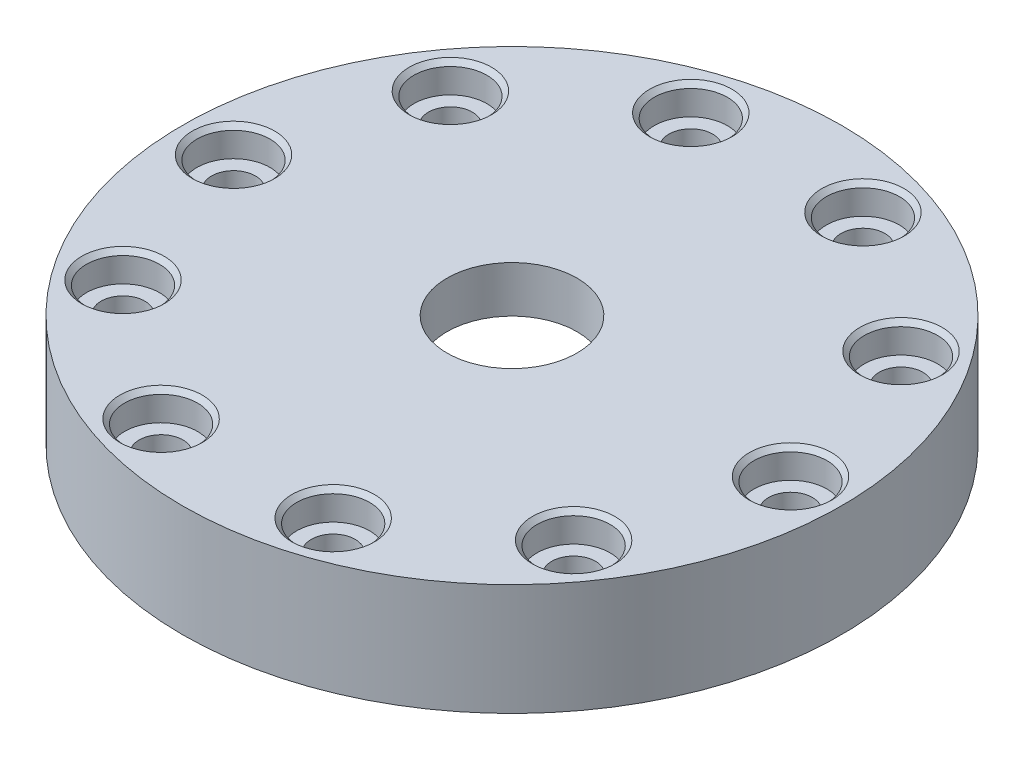
ISO-10303-21;
HEADER;
FILE_DESCRIPTION(('STEP AP214'),'2;1');
FILE_NAME('part.step','',(''),(''),'','','');
FILE_SCHEMA(('AUTOMOTIVE_DESIGN { 1 0 10303 214 1 1 1 1 }'));
ENDSEC;
DATA;
#1=APPLICATION_CONTEXT('core data for automotive mechanical design processes');
#2=APPLICATION_PROTOCOL_DEFINITION('international standard','automotive_design',2000,#1);
#3=PRODUCT_CONTEXT('',#1,'mechanical');
#4=PRODUCT('Part','Part','',(#3));
#5=PRODUCT_RELATED_PRODUCT_CATEGORY('part','',(#4));
#6=PRODUCT_DEFINITION_FORMATION('','',#4);
#7=PRODUCT_DEFINITION_CONTEXT('part definition',#1,'design');
#8=PRODUCT_DEFINITION('design','',#6,#7);
#9=PRODUCT_DEFINITION_SHAPE('','',#8);
#10=(LENGTH_UNIT() NAMED_UNIT(*) SI_UNIT(.MILLI.,.METRE.));
#11=(NAMED_UNIT(*) PLANE_ANGLE_UNIT() SI_UNIT($,.RADIAN.));
#12=(NAMED_UNIT(*) SI_UNIT($,.STERADIAN.) SOLID_ANGLE_UNIT());
#13=UNCERTAINTY_MEASURE_WITH_UNIT(LENGTH_MEASURE(1.E-05),#10,'distance_accuracy_value','');
#14=(GEOMETRIC_REPRESENTATION_CONTEXT(3) GLOBAL_UNCERTAINTY_ASSIGNED_CONTEXT((#13)) GLOBAL_UNIT_ASSIGNED_CONTEXT((#10,
#11,#12)) REPRESENTATION_CONTEXT('',''));
#15=CARTESIAN_POINT('',(0.,0.,0.));
#16=DIRECTION('',(0.,0.,1.));
#17=DIRECTION('',(1.,0.,0.));
#18=AXIS2_PLACEMENT_3D('',#15,#16,#17);
#19=CARTESIAN_POINT('',(0.,0.,0.));
#20=DIRECTION('',(0.,-1.,0.));
#21=DIRECTION('',(0.,0.,-1.));
#22=AXIS2_PLACEMENT_3D('',#19,#20,#21);
#23=CYLINDRICAL_SURFACE('',#22,8.89);
#24=CARTESIAN_POINT('',(0.,-6.35,0.));
#25=DIRECTION('',(0.,-1.,0.));
#26=DIRECTION('',(0.,0.,-1.));
#27=AXIS2_PLACEMENT_3D('',#24,#25,#26);
#28=CIRCLE('',#27,8.89);
#29=CARTESIAN_POINT('',(0.,-6.35,-8.89));
#30=VERTEX_POINT('',#29);
#31=EDGE_CURVE('E127',#30,#30,#28,.T.);
#32=ORIENTED_EDGE('',*,*,#31,.T.);
#33=EDGE_LOOP('',(#32));
#34=FACE_BOUND('',#33,.T.);
#35=CARTESIAN_POINT('',(0.,0.,0.));
#36=DIRECTION('',(0.,-1.,0.));
#37=DIRECTION('',(0.,0.,-1.));
#38=AXIS2_PLACEMENT_3D('',#35,#36,#37);
#39=CIRCLE('',#38,8.89);
#40=CARTESIAN_POINT('',(0.,0.,-8.89));
#41=VERTEX_POINT('',#40);
#42=EDGE_CURVE('E142',#41,#41,#39,.T.);
#43=ORIENTED_EDGE('',*,*,#42,.F.);
#44=EDGE_LOOP('',(#43));
#45=FACE_BOUND('',#44,.T.);
#46=ADVANCED_FACE('F39',(#34,#45),#23,.F.);
#47=CARTESIAN_POINT('',(8.89,-6.35,0.));
#48=DIRECTION('',(0.,-1.,0.));
#49=DIRECTION('',(0.,0.,-1.));
#50=AXIS2_PLACEMENT_3D('',#47,#48,#49);
#51=PLANE('',#50);
#52=CARTESIAN_POINT('',(0.,-6.35,0.));
#53=DIRECTION('',(0.,-1.,0.));
#54=DIRECTION('',(0.,0.,-1.));
#55=AXIS2_PLACEMENT_3D('',#52,#53,#54);
#56=CIRCLE('',#55,22.86);
#57=CARTESIAN_POINT('',(0.,-6.35,-22.86));
#58=VERTEX_POINT('',#57);
#59=EDGE_CURVE('E47',#58,#58,#56,.T.);
#60=ORIENTED_EDGE('',*,*,#59,.T.);
#61=EDGE_LOOP('',(#60));
#62=FACE_BOUND('',#61,.T.);
#63=ORIENTED_EDGE('',*,*,#31,.F.);
#64=EDGE_LOOP('',(#63));
#65=FACE_BOUND('',#64,.T.);
#66=ADVANCED_FACE('F276',(#62,#65),#51,.T.);
#67=CARTESIAN_POINT('',(0.,0.,0.));
#68=DIRECTION('',(0.,-1.,0.));
#69=DIRECTION('',(0.,0.,-1.));
#70=AXIS2_PLACEMENT_3D('',#67,#68,#69);
#71=CYLINDRICAL_SURFACE('',#70,24.13);
#72=CARTESIAN_POINT('',(0.,-7.62,0.));
#73=DIRECTION('',(0.,-1.,0.));
#74=DIRECTION('',(0.,0.,-1.));
#75=AXIS2_PLACEMENT_3D('',#72,#73,#74);
#76=CIRCLE('',#75,24.13);
#77=CARTESIAN_POINT('',(0.,-7.62,-24.13));
#78=VERTEX_POINT('',#77);
#79=EDGE_CURVE('E10',#78,#78,#76,.F.);
#80=ORIENTED_EDGE('',*,*,#79,.T.);
#81=EDGE_LOOP('',(#80));
#82=FACE_BOUND('',#81,.T.);
#83=CARTESIAN_POINT('',(0.,-15.2654,0.));
#84=DIRECTION('',(0.,-1.,0.));
#85=DIRECTION('',(0.,0.,-1.));
#86=AXIS2_PLACEMENT_3D('',#83,#84,#85);
#87=CIRCLE('',#86,24.13);
#88=CARTESIAN_POINT('',(0.,-15.2654,-24.13));
#89=VERTEX_POINT('',#88);
#90=EDGE_CURVE('E131',#89,#89,#87,.T.);
#91=ORIENTED_EDGE('',*,*,#90,.T.);
#92=EDGE_LOOP('',(#91));
#93=FACE_BOUND('',#92,.T.);
#94=ADVANCED_FACE('F282',(#82,#93),#71,.F.);
#95=CARTESIAN_POINT('',(24.13,-15.2654,0.));
#96=DIRECTION('',(0.,-1.,0.));
#97=DIRECTION('',(0.,0.,-1.));
#98=AXIS2_PLACEMENT_3D('',#95,#96,#97);
#99=PLANE('',#98);
#100=CARTESIAN_POINT('',(30.8235474856858,-15.2654,-22.3946181123428));
#101=DIRECTION('',(0.,-1.,0.));
#102=DIRECTION('',(0.,0.,-1.));
#103=AXIS2_PLACEMENT_3D('',#100,#101,#102);
#104=CIRCLE('',#103,3.00000000000001);
#105=CARTESIAN_POINT('',(30.8235474856858,-15.2654,-25.3946181123428));
#106=VERTEX_POINT('',#105);
#107=EDGE_CURVE('E245',#106,#106,#104,.T.);
#108=ORIENTED_EDGE('',*,*,#107,.F.);
#109=EDGE_LOOP('',(#108));
#110=FACE_BOUND('',#109,.T.);
#111=CARTESIAN_POINT('',(11.7735474856859,-15.2654,-36.2352532708452));
#112=DIRECTION('',(0.,-1.,0.));
#113=DIRECTION('',(0.,0.,-1.));
#114=AXIS2_PLACEMENT_3D('',#111,#112,#113);
#115=CIRCLE('',#114,3.00000000000001);
#116=CARTESIAN_POINT('',(11.7735474856859,-15.2654,-39.2352532708452));
#117=VERTEX_POINT('',#116);
#118=EDGE_CURVE('E234',#117,#117,#115,.T.);
#119=ORIENTED_EDGE('',*,*,#118,.F.);
#120=EDGE_LOOP('',(#119));
#121=FACE_BOUND('',#120,.T.);
#122=CARTESIAN_POINT('',(-11.7735474856851,-15.2654,-36.2352532708455));
#123=DIRECTION('',(0.,-1.,0.));
#124=DIRECTION('',(0.,0.,-1.));
#125=AXIS2_PLACEMENT_3D('',#122,#123,#124);
#126=CIRCLE('',#125,3.00000000000001);
#127=CARTESIAN_POINT('',(-11.7735474856851,-15.2654,-39.2352532708455));
#128=VERTEX_POINT('',#127);
#129=EDGE_CURVE('E224',#128,#128,#126,.T.);
#130=ORIENTED_EDGE('',*,*,#129,.F.);
#131=EDGE_LOOP('',(#130));
#132=FACE_BOUND('',#131,.T.);
#133=CARTESIAN_POINT('',(-30.8235474856853,-15.2654,-22.3946181123435));
#134=DIRECTION('',(0.,-1.,0.));
#135=DIRECTION('',(0.,0.,-1.));
#136=AXIS2_PLACEMENT_3D('',#133,#134,#135);
#137=CIRCLE('',#136,3.00000000000001);
#138=CARTESIAN_POINT('',(-30.8235474856853,-15.2654,-25.3946181123435));
#139=VERTEX_POINT('',#138);
#140=EDGE_CURVE('E214',#139,#139,#137,.T.);
#141=ORIENTED_EDGE('',*,*,#140,.F.);
#142=EDGE_LOOP('',(#141));
#143=FACE_BOUND('',#142,.T.);
#144=CARTESIAN_POINT('',(-38.1,-15.2654,0.));
#145=DIRECTION('',(0.,-1.,0.));
#146=DIRECTION('',(0.,0.,-1.));
#147=AXIS2_PLACEMENT_3D('',#144,#145,#146);
#148=CIRCLE('',#147,3.00000000000001);
#149=CARTESIAN_POINT('',(-38.1,-15.2654,-3.00000000000001));
#150=VERTEX_POINT('',#149);
#151=EDGE_CURVE('E203',#150,#150,#148,.T.);
#152=ORIENTED_EDGE('',*,*,#151,.F.);
#153=EDGE_LOOP('',(#152));
#154=FACE_BOUND('',#153,.T.);
#155=CARTESIAN_POINT('',(-30.8235474856856,-15.2654,22.3946181123431));
#156=DIRECTION('',(0.,-1.,0.));
#157=DIRECTION('',(0.,0.,-1.));
#158=AXIS2_PLACEMENT_3D('',#155,#156,#157);
#159=CIRCLE('',#158,3.00000000000001);
#160=CARTESIAN_POINT('',(-30.8235474856856,-15.2654,19.394618112343));
#161=VERTEX_POINT('',#160);
#162=EDGE_CURVE('E193',#161,#161,#159,.T.);
#163=ORIENTED_EDGE('',*,*,#162,.F.);
#164=EDGE_LOOP('',(#163));
#165=FACE_BOUND('',#164,.T.);
#166=CARTESIAN_POINT('',(-11.7735474856857,-15.2654,36.2352532708453));
#167=DIRECTION('',(0.,-1.,0.));
#168=DIRECTION('',(0.,0.,-1.));
#169=AXIS2_PLACEMENT_3D('',#166,#167,#168);
#170=CIRCLE('',#169,3.00000000000001);
#171=CARTESIAN_POINT('',(-11.7735474856857,-15.2654,33.2352532708453));
#172=VERTEX_POINT('',#171);
#173=EDGE_CURVE('E181',#172,#172,#170,.T.);
#174=ORIENTED_EDGE('',*,*,#173,.F.);
#175=EDGE_LOOP('',(#174));
#176=FACE_BOUND('',#175,.T.);
#177=CARTESIAN_POINT('',(11.7735474856854,-15.2654,36.2352532708454));
#178=DIRECTION('',(0.,-1.,0.));
#179=DIRECTION('',(0.,0.,-1.));
#180=AXIS2_PLACEMENT_3D('',#177,#178,#179);
#181=CIRCLE('',#180,3.00000000000001);
#182=CARTESIAN_POINT('',(11.7735474856854,-15.2654,33.2352532708454));
#183=VERTEX_POINT('',#182);
#184=EDGE_CURVE('E169',#183,#183,#181,.T.);
#185=ORIENTED_EDGE('',*,*,#184,.F.);
#186=EDGE_LOOP('',(#185));
#187=FACE_BOUND('',#186,.T.);
#188=CARTESIAN_POINT('',(30.8235474856855,-15.2654,22.3946181123433));
#189=DIRECTION('',(0.,-1.,0.));
#190=DIRECTION('',(0.,0.,-1.));
#191=AXIS2_PLACEMENT_3D('',#188,#189,#190);
#192=CIRCLE('',#191,3.00000000000001);
#193=CARTESIAN_POINT('',(30.8235474856855,-15.2654,19.3946181123433));
#194=VERTEX_POINT('',#193);
#195=EDGE_CURVE('E157',#194,#194,#192,.T.);
#196=ORIENTED_EDGE('',*,*,#195,.F.);
#197=EDGE_LOOP('',(#196));
#198=FACE_BOUND('',#197,.T.);
#199=CARTESIAN_POINT('',(38.1,-15.2654,0.));
#200=DIRECTION('',(0.,-1.,0.));
#201=DIRECTION('',(0.,0.,-1.));
#202=AXIS2_PLACEMENT_3D('',#199,#200,#201);
#203=CIRCLE('',#202,3.00000000000001);
#204=CARTESIAN_POINT('',(38.1,-15.2654,-3.00000000000001));
#205=VERTEX_POINT('',#204);
#206=EDGE_CURVE('E146',#205,#205,#203,.T.);
#207=ORIENTED_EDGE('',*,*,#206,.F.);
#208=EDGE_LOOP('',(#207));
#209=FACE_BOUND('',#208,.T.);
#210=CARTESIAN_POINT('',(0.,-15.2654,0.));
#211=DIRECTION('',(0.,-1.,0.));
#212=DIRECTION('',(0.,0.,-1.));
#213=AXIS2_PLACEMENT_3D('',#210,#211,#212);
#214=CIRCLE('',#213,45.085);
#215=CARTESIAN_POINT('',(0.,-15.2654,-45.085));
#216=VERTEX_POINT('',#215);
#217=EDGE_CURVE('E134',#216,#216,#214,.T.);
#218=ORIENTED_EDGE('',*,*,#217,.T.);
#219=EDGE_LOOP('',(#218));
#220=FACE_BOUND('',#219,.T.);
#221=ORIENTED_EDGE('',*,*,#90,.F.);
#222=EDGE_LOOP('',(#221));
#223=FACE_BOUND('',#222,.T.);
#224=ADVANCED_FACE('F360',(#110,#121,#132,#143,#154,#165,#176,#187,#198,#209,#220,#223),#99,.T.);
#225=CARTESIAN_POINT('',(0.,0.,0.));
#226=DIRECTION('',(0.,-1.,0.));
#227=DIRECTION('',(0.,0.,-1.));
#228=AXIS2_PLACEMENT_3D('',#225,#226,#227);
#229=CYLINDRICAL_SURFACE('',#228,45.085);
#230=CARTESIAN_POINT('',(0.,0.,0.));
#231=DIRECTION('',(0.,-1.,0.));
#232=DIRECTION('',(0.,0.,-1.));
#233=AXIS2_PLACEMENT_3D('',#230,#231,#232);
#234=CIRCLE('',#233,45.085);
#235=CARTESIAN_POINT('',(0.,0.,-45.085));
#236=VERTEX_POINT('',#235);
#237=EDGE_CURVE('E138',#236,#236,#234,.T.);
#238=ORIENTED_EDGE('',*,*,#237,.T.);
#239=EDGE_LOOP('',(#238));
#240=FACE_BOUND('',#239,.T.);
#241=ORIENTED_EDGE('',*,*,#217,.F.);
#242=EDGE_LOOP('',(#241));
#243=FACE_BOUND('',#242,.T.);
#244=ADVANCED_FACE('F334',(#240,#243),#229,.T.);
#245=CARTESIAN_POINT('',(8.89,0.,0.));
#246=DIRECTION('',(0.,1.,0.));
#247=DIRECTION('',(0.,0.,1.));
#248=AXIS2_PLACEMENT_3D('',#245,#246,#247);
#249=PLANE('',#248);
#250=CARTESIAN_POINT('',(30.8235474856858,0.,-22.3946181123428));
#251=DIRECTION('',(0.,1.,0.));
#252=DIRECTION('',(0.,0.,1.));
#253=AXIS2_PLACEMENT_3D('',#250,#251,#252);
#254=CIRCLE('',#253,5.63500000000006);
#255=CARTESIAN_POINT('',(30.8235474856858,0.,-16.7596181123428));
#256=VERTEX_POINT('',#255);
#257=EDGE_CURVE('E53',#256,#256,#254,.F.);
#258=ORIENTED_EDGE('',*,*,#257,.T.);
#259=EDGE_LOOP('',(#258));
#260=FACE_BOUND('',#259,.T.);
#261=CARTESIAN_POINT('',(11.7735474856859,0.,-36.2352532708452));
#262=DIRECTION('',(0.,1.,0.));
#263=DIRECTION('',(0.,0.,1.));
#264=AXIS2_PLACEMENT_3D('',#261,#262,#263);
#265=CIRCLE('',#264,5.63500000000001);
#266=CARTESIAN_POINT('',(11.7735474856859,0.,-30.6002532708452));
#267=VERTEX_POINT('',#266);
#268=EDGE_CURVE('E65',#267,#267,#265,.F.);
#269=ORIENTED_EDGE('',*,*,#268,.T.);
#270=EDGE_LOOP('',(#269));
#271=FACE_BOUND('',#270,.T.);
#272=CARTESIAN_POINT('',(-11.7735474856851,0.,-36.2352532708455));
#273=DIRECTION('',(0.,1.,0.));
#274=DIRECTION('',(0.,0.,1.));
#275=AXIS2_PLACEMENT_3D('',#272,#273,#274);
#276=CIRCLE('',#275,5.63500000000006);
#277=CARTESIAN_POINT('',(-11.7735474856851,0.,-30.6002532708454));
#278=VERTEX_POINT('',#277);
#279=EDGE_CURVE('E71',#278,#278,#276,.F.);
#280=ORIENTED_EDGE('',*,*,#279,.T.);
#281=EDGE_LOOP('',(#280));
#282=FACE_BOUND('',#281,.T.);
#283=CARTESIAN_POINT('',(-30.8235474856853,0.,-22.3946181123435));
#284=DIRECTION('',(0.,1.,0.));
#285=DIRECTION('',(0.,0.,1.));
#286=AXIS2_PLACEMENT_3D('',#283,#284,#285);
#287=CIRCLE('',#286,5.63500000000006);
#288=CARTESIAN_POINT('',(-30.8235474856853,0.,-16.7596181123434));
#289=VERTEX_POINT('',#288);
#290=EDGE_CURVE('E77',#289,#289,#287,.F.);
#291=ORIENTED_EDGE('',*,*,#290,.T.);
#292=EDGE_LOOP('',(#291));
#293=FACE_BOUND('',#292,.T.);
#294=CARTESIAN_POINT('',(-38.1,0.,0.));
#295=DIRECTION('',(0.,1.,0.));
#296=DIRECTION('',(0.,0.,1.));
#297=AXIS2_PLACEMENT_3D('',#294,#295,#296);
#298=CIRCLE('',#297,5.63500000000006);
#299=CARTESIAN_POINT('',(-38.1,0.,5.63500000000006));
#300=VERTEX_POINT('',#299);
#301=EDGE_CURVE('E83',#300,#300,#298,.F.);
#302=ORIENTED_EDGE('',*,*,#301,.T.);
#303=EDGE_LOOP('',(#302));
#304=FACE_BOUND('',#303,.T.);
#305=CARTESIAN_POINT('',(-30.8235474856856,0.,22.3946181123431));
#306=DIRECTION('',(0.,1.,0.));
#307=DIRECTION('',(0.,0.,1.));
#308=AXIS2_PLACEMENT_3D('',#305,#306,#307);
#309=CIRCLE('',#308,5.63500000000006);
#310=CARTESIAN_POINT('',(-30.8235474856856,0.,28.0296181123431));
#311=VERTEX_POINT('',#310);
#312=EDGE_CURVE('E89',#311,#311,#309,.F.);
#313=ORIENTED_EDGE('',*,*,#312,.T.);
#314=EDGE_LOOP('',(#313));
#315=FACE_BOUND('',#314,.T.);
#316=CARTESIAN_POINT('',(-11.7735474856857,0.,36.2352532708453));
#317=DIRECTION('',(0.,1.,0.));
#318=DIRECTION('',(0.,0.,1.));
#319=AXIS2_PLACEMENT_3D('',#316,#317,#318);
#320=CIRCLE('',#319,5.63500000000006);
#321=CARTESIAN_POINT('',(-11.7735474856857,0.,41.8702532708454));
#322=VERTEX_POINT('',#321);
#323=EDGE_CURVE('E95',#322,#322,#320,.F.);
#324=ORIENTED_EDGE('',*,*,#323,.T.);
#325=EDGE_LOOP('',(#324));
#326=FACE_BOUND('',#325,.T.);
#327=CARTESIAN_POINT('',(11.7735474856854,0.,36.2352532708454));
#328=DIRECTION('',(0.,1.,0.));
#329=DIRECTION('',(0.,0.,1.));
#330=AXIS2_PLACEMENT_3D('',#327,#328,#329);
#331=CIRCLE('',#330,5.63500000000006);
#332=CARTESIAN_POINT('',(11.7735474856854,0.,41.8702532708455));
#333=VERTEX_POINT('',#332);
#334=EDGE_CURVE('E103',#333,#333,#331,.F.);
#335=ORIENTED_EDGE('',*,*,#334,.T.);
#336=EDGE_LOOP('',(#335));
#337=FACE_BOUND('',#336,.T.);
#338=CARTESIAN_POINT('',(30.8235474856855,0.,22.3946181123433));
#339=DIRECTION('',(0.,1.,0.));
#340=DIRECTION('',(0.,0.,1.));
#341=AXIS2_PLACEMENT_3D('',#338,#339,#340);
#342=CIRCLE('',#341,5.63500000000006);
#343=CARTESIAN_POINT('',(30.8235474856855,0.,28.0296181123433));
#344=VERTEX_POINT('',#343);
#345=EDGE_CURVE('E111',#344,#344,#342,.F.);
#346=ORIENTED_EDGE('',*,*,#345,.T.);
#347=EDGE_LOOP('',(#346));
#348=FACE_BOUND('',#347,.T.);
#349=CARTESIAN_POINT('',(38.1,0.,0.));
#350=DIRECTION('',(0.,1.,0.));
#351=DIRECTION('',(0.,0.,1.));
#352=AXIS2_PLACEMENT_3D('',#349,#350,#351);
#353=CIRCLE('',#352,5.63500000000006);
#354=CARTESIAN_POINT('',(38.1,0.,5.63500000000006));
#355=VERTEX_POINT('',#354);
#356=EDGE_CURVE('E119',#355,#355,#353,.F.);
#357=ORIENTED_EDGE('',*,*,#356,.T.);
#358=EDGE_LOOP('',(#357));
#359=FACE_BOUND('',#358,.T.);
#360=ORIENTED_EDGE('',*,*,#42,.T.);
#361=EDGE_LOOP('',(#360));
#362=FACE_BOUND('',#361,.T.);
#363=ORIENTED_EDGE('',*,*,#237,.F.);
#364=EDGE_LOOP('',(#363));
#365=FACE_BOUND('',#364,.T.);
#366=ADVANCED_FACE('F330',(#260,#271,#282,#293,#304,#315,#326,#337,#348,#359,#362,#365),#249,.T.);
#367=CARTESIAN_POINT('',(38.1,0.,0.));
#368=DIRECTION('',(0.,1.,0.));
#369=DIRECTION('',(0.,0.,1.));
#370=AXIS2_PLACEMENT_3D('',#367,#368,#369);
#371=CYLINDRICAL_SURFACE('',#370,3.00000000000001);
#372=CARTESIAN_POINT('',(38.1,-4.,0.));
#373=DIRECTION('',(0.,1.,0.));
#374=DIRECTION('',(0.,0.,1.));
#375=AXIS2_PLACEMENT_3D('',#372,#373,#374);
#376=CIRCLE('',#375,3.00000000000001);
#377=CARTESIAN_POINT('',(38.1,-4.,3.00000000000001));
#378=VERTEX_POINT('',#377);
#379=EDGE_CURVE('E149',#378,#378,#376,.T.);
#380=ORIENTED_EDGE('',*,*,#379,.T.);
#381=EDGE_LOOP('',(#380));
#382=FACE_BOUND('',#381,.T.);
#383=ORIENTED_EDGE('',*,*,#206,.T.);
#384=EDGE_LOOP('',(#383));
#385=FACE_BOUND('',#384,.T.);
#386=ADVANCED_FACE('F333',(#382,#385),#371,.F.);
#387=CARTESIAN_POINT('',(41.1,-4.,0.));
#388=DIRECTION('',(0.,-1.,0.));
#389=DIRECTION('',(0.,0.,-1.));
#390=AXIS2_PLACEMENT_3D('',#387,#388,#389);
#391=PLANE('',#390);
#392=ORIENTED_EDGE('',*,*,#379,.F.);
#393=EDGE_LOOP('',(#392));
#394=FACE_BOUND('',#393,.T.);
#395=CARTESIAN_POINT('',(38.1,-4.,0.));
#396=DIRECTION('',(0.,1.,0.));
#397=DIRECTION('',(0.,0.,1.));
#398=AXIS2_PLACEMENT_3D('',#395,#396,#397);
#399=CIRCLE('',#398,5.00000000000001);
#400=CARTESIAN_POINT('',(38.1,-4.,5.00000000000001));
#401=VERTEX_POINT('',#400);
#402=EDGE_CURVE('E153',#401,#401,#399,.T.);
#403=ORIENTED_EDGE('',*,*,#402,.T.);
#404=EDGE_LOOP('',(#403));
#405=FACE_BOUND('',#404,.T.);
#406=ADVANCED_FACE('F376',(#394,#405),#391,.F.);
#407=CARTESIAN_POINT('',(38.1,0.,0.));
#408=DIRECTION('',(0.,1.,0.));
#409=DIRECTION('',(0.,0.,1.));
#410=AXIS2_PLACEMENT_3D('',#407,#408,#409);
#411=CYLINDRICAL_SURFACE('',#410,5.00000000000001);
#412=CARTESIAN_POINT('',(38.1,-0.635000000000034,0.));
#413=DIRECTION('',(0.,1.,0.));
#414=DIRECTION('',(0.,0.,1.));
#415=AXIS2_PLACEMENT_3D('',#412,#413,#414);
#416=CIRCLE('',#415,5.00000000000001);
#417=CARTESIAN_POINT('',(38.1,-0.635000000000034,5.00000000000001));
#418=VERTEX_POINT('',#417);
#419=EDGE_CURVE('E123',#418,#418,#416,.T.);
#420=ORIENTED_EDGE('',*,*,#419,.T.);
#421=EDGE_LOOP('',(#420));
#422=FACE_BOUND('',#421,.T.);
#423=ORIENTED_EDGE('',*,*,#402,.F.);
#424=EDGE_LOOP('',(#423));
#425=FACE_BOUND('',#424,.T.);
#426=ADVANCED_FACE('F290',(#422,#425),#411,.F.);
#427=CARTESIAN_POINT('',(38.1,-0.635000000000034,0.));
#428=DIRECTION('',(0.,1.,0.));
#429=DIRECTION('',(0.,0.,1.));
#430=AXIS2_PLACEMENT_3D('',#427,#428,#429);
#431=CONICAL_SURFACE('',#430,5.00000000000001,0.785398163397457);
#432=ORIENTED_EDGE('',*,*,#356,.F.);
#433=EDGE_LOOP('',(#432));
#434=FACE_BOUND('',#433,.T.);
#435=ORIENTED_EDGE('',*,*,#419,.F.);
#436=EDGE_LOOP('',(#435));
#437=FACE_BOUND('',#436,.T.);
#438=ADVANCED_FACE('F287',(#434,#437),#431,.F.);
#439=CARTESIAN_POINT('',(30.8235474856855,0.,22.3946181123433));
#440=DIRECTION('',(0.,1.,0.));
#441=DIRECTION('',(0.,0.,1.));
#442=AXIS2_PLACEMENT_3D('',#439,#440,#441);
#443=CYLINDRICAL_SURFACE('',#442,3.00000000000001);
#444=CARTESIAN_POINT('',(30.8235474856855,-4.,22.3946181123433));
#445=DIRECTION('',(0.,1.,0.));
#446=DIRECTION('',(0.,0.,1.));
#447=AXIS2_PLACEMENT_3D('',#444,#445,#446);
#448=CIRCLE('',#447,3.00000000000001);
#449=CARTESIAN_POINT('',(30.8235474856855,-4.,25.3946181123433));
#450=VERTEX_POINT('',#449);
#451=EDGE_CURVE('E161',#450,#450,#448,.T.);
#452=ORIENTED_EDGE('',*,*,#451,.T.);
#453=EDGE_LOOP('',(#452));
#454=FACE_BOUND('',#453,.T.);
#455=ORIENTED_EDGE('',*,*,#195,.T.);
#456=EDGE_LOOP('',(#455));
#457=FACE_BOUND('',#456,.T.);
#458=ADVANCED_FACE('F289',(#454,#457),#443,.F.);
#459=CARTESIAN_POINT('',(33.8235474856855,-4.,22.3946181123433));
#460=DIRECTION('',(0.,-1.,0.));
#461=DIRECTION('',(0.,0.,-1.));
#462=AXIS2_PLACEMENT_3D('',#459,#460,#461);
#463=PLANE('',#462);
#464=ORIENTED_EDGE('',*,*,#451,.F.);
#465=EDGE_LOOP('',(#464));
#466=FACE_BOUND('',#465,.T.);
#467=CARTESIAN_POINT('',(30.8235474856855,-4.,22.3946181123433));
#468=DIRECTION('',(0.,1.,0.));
#469=DIRECTION('',(0.,0.,1.));
#470=AXIS2_PLACEMENT_3D('',#467,#468,#469);
#471=CIRCLE('',#470,5.00000000000002);
#472=CARTESIAN_POINT('',(30.8235474856855,-4.,27.3946181123433));
#473=VERTEX_POINT('',#472);
#474=EDGE_CURVE('E165',#473,#473,#471,.T.);
#475=ORIENTED_EDGE('',*,*,#474,.T.);
#476=EDGE_LOOP('',(#475));
#477=FACE_BOUND('',#476,.T.);
#478=ADVANCED_FACE('F386',(#466,#477),#463,.F.);
#479=CARTESIAN_POINT('',(30.8235474856855,0.,22.3946181123433));
#480=DIRECTION('',(0.,1.,0.));
#481=DIRECTION('',(0.,0.,1.));
#482=AXIS2_PLACEMENT_3D('',#479,#480,#481);
#483=CYLINDRICAL_SURFACE('',#482,5.00000000000002);
#484=CARTESIAN_POINT('',(30.8235474856855,-0.635000000000031,22.3946181123433));
#485=DIRECTION('',(0.,1.,0.));
#486=DIRECTION('',(0.,0.,1.));
#487=AXIS2_PLACEMENT_3D('',#484,#485,#486);
#488=CIRCLE('',#487,5.00000000000002);
#489=CARTESIAN_POINT('',(30.8235474856855,-0.635000000000031,27.3946181123433));
#490=VERTEX_POINT('',#489);
#491=EDGE_CURVE('E115',#490,#490,#488,.T.);
#492=ORIENTED_EDGE('',*,*,#491,.T.);
#493=EDGE_LOOP('',(#492));
#494=FACE_BOUND('',#493,.T.);
#495=ORIENTED_EDGE('',*,*,#474,.F.);
#496=EDGE_LOOP('',(#495));
#497=FACE_BOUND('',#496,.T.);
#498=ADVANCED_FACE('F390',(#494,#497),#483,.F.);
#499=CARTESIAN_POINT('',(11.7735474856854,0.,36.2352532708454));
#500=DIRECTION('',(0.,1.,0.));
#501=DIRECTION('',(0.,0.,1.));
#502=AXIS2_PLACEMENT_3D('',#499,#500,#501);
#503=CYLINDRICAL_SURFACE('',#502,3.00000000000001);
#504=CARTESIAN_POINT('',(11.7735474856854,-4.,36.2352532708454));
#505=DIRECTION('',(0.,1.,0.));
#506=DIRECTION('',(0.,0.,1.));
#507=AXIS2_PLACEMENT_3D('',#504,#505,#506);
#508=CIRCLE('',#507,3.00000000000001);
#509=CARTESIAN_POINT('',(11.7735474856854,-4.,39.2352532708454));
#510=VERTEX_POINT('',#509);
#511=EDGE_CURVE('E173',#510,#510,#508,.T.);
#512=ORIENTED_EDGE('',*,*,#511,.T.);
#513=EDGE_LOOP('',(#512));
#514=FACE_BOUND('',#513,.T.);
#515=ORIENTED_EDGE('',*,*,#184,.T.);
#516=EDGE_LOOP('',(#515));
#517=FACE_BOUND('',#516,.T.);
#518=ADVANCED_FACE('F394',(#514,#517),#503,.F.);
#519=CARTESIAN_POINT('',(14.7735474856854,-4.,36.2352532708454));
#520=DIRECTION('',(0.,-1.,0.));
#521=DIRECTION('',(0.,0.,-1.));
#522=AXIS2_PLACEMENT_3D('',#519,#520,#521);
#523=PLANE('',#522);
#524=ORIENTED_EDGE('',*,*,#511,.F.);
#525=EDGE_LOOP('',(#524));
#526=FACE_BOUND('',#525,.T.);
#527=CARTESIAN_POINT('',(11.7735474856854,-4.,36.2352532708454));
#528=DIRECTION('',(0.,1.,0.));
#529=DIRECTION('',(0.,0.,1.));
#530=AXIS2_PLACEMENT_3D('',#527,#528,#529);
#531=CIRCLE('',#530,5.00000000000002);
#532=CARTESIAN_POINT('',(11.7735474856854,-4.,41.2352532708454));
#533=VERTEX_POINT('',#532);
#534=EDGE_CURVE('E177',#533,#533,#531,.T.);
#535=ORIENTED_EDGE('',*,*,#534,.T.);
#536=EDGE_LOOP('',(#535));
#537=FACE_BOUND('',#536,.T.);
#538=ADVANCED_FACE('F398',(#526,#537),#523,.F.);
#539=CARTESIAN_POINT('',(11.7735474856854,0.,36.2352532708454));
#540=DIRECTION('',(0.,1.,0.));
#541=DIRECTION('',(0.,0.,1.));
#542=AXIS2_PLACEMENT_3D('',#539,#540,#541);
#543=CYLINDRICAL_SURFACE('',#542,5.00000000000002);
#544=CARTESIAN_POINT('',(11.7735474856854,-0.635000000000031,36.2352532708454));
#545=DIRECTION('',(0.,1.,0.));
#546=DIRECTION('',(0.,0.,1.));
#547=AXIS2_PLACEMENT_3D('',#544,#545,#546);
#548=CIRCLE('',#547,5.00000000000002);
#549=CARTESIAN_POINT('',(11.7735474856854,-0.635000000000031,41.2352532708454));
#550=VERTEX_POINT('',#549);
#551=EDGE_CURVE('E107',#550,#550,#548,.T.);
#552=ORIENTED_EDGE('',*,*,#551,.T.);
#553=EDGE_LOOP('',(#552));
#554=FACE_BOUND('',#553,.T.);
#555=ORIENTED_EDGE('',*,*,#534,.F.);
#556=EDGE_LOOP('',(#555));
#557=FACE_BOUND('',#556,.T.);
#558=ADVANCED_FACE('F402',(#554,#557),#543,.F.);
#559=CARTESIAN_POINT('',(-11.7735474856857,0.,36.2352532708453));
#560=DIRECTION('',(0.,1.,0.));
#561=DIRECTION('',(0.,0.,1.));
#562=AXIS2_PLACEMENT_3D('',#559,#560,#561);
#563=CYLINDRICAL_SURFACE('',#562,3.00000000000001);
#564=CARTESIAN_POINT('',(-11.7735474856857,-4.,36.2352532708453));
#565=DIRECTION('',(0.,1.,0.));
#566=DIRECTION('',(0.,0.,1.));
#567=AXIS2_PLACEMENT_3D('',#564,#565,#566);
#568=CIRCLE('',#567,3.00000000000001);
#569=CARTESIAN_POINT('',(-11.7735474856857,-4.,39.2352532708453));
#570=VERTEX_POINT('',#569);
#571=EDGE_CURVE('E185',#570,#570,#568,.T.);
#572=ORIENTED_EDGE('',*,*,#571,.T.);
#573=EDGE_LOOP('',(#572));
#574=FACE_BOUND('',#573,.T.);
#575=ORIENTED_EDGE('',*,*,#173,.T.);
#576=EDGE_LOOP('',(#575));
#577=FACE_BOUND('',#576,.T.);
#578=ADVANCED_FACE('F406',(#574,#577),#563,.F.);
#579=CARTESIAN_POINT('',(-8.77354748568565,-4.,36.2352532708453));
#580=DIRECTION('',(0.,-1.,0.));
#581=DIRECTION('',(0.,0.,-1.));
#582=AXIS2_PLACEMENT_3D('',#579,#580,#581);
#583=PLANE('',#582);
#584=ORIENTED_EDGE('',*,*,#571,.F.);
#585=EDGE_LOOP('',(#584));
#586=FACE_BOUND('',#585,.T.);
#587=CARTESIAN_POINT('',(-11.7735474856857,-4.,36.2352532708453));
#588=DIRECTION('',(0.,1.,0.));
#589=DIRECTION('',(0.,0.,1.));
#590=AXIS2_PLACEMENT_3D('',#587,#588,#589);
#591=CIRCLE('',#590,5.00000000000001);
#592=CARTESIAN_POINT('',(-11.7735474856857,-4.,41.2352532708453));
#593=VERTEX_POINT('',#592);
#594=EDGE_CURVE('E189',#593,#593,#591,.T.);
#595=ORIENTED_EDGE('',*,*,#594,.T.);
#596=EDGE_LOOP('',(#595));
#597=FACE_BOUND('',#596,.T.);
#598=ADVANCED_FACE('F410',(#586,#597),#583,.F.);
#599=CARTESIAN_POINT('',(-11.7735474856857,0.,36.2352532708453));
#600=DIRECTION('',(0.,1.,0.));
#601=DIRECTION('',(0.,0.,1.));
#602=AXIS2_PLACEMENT_3D('',#599,#600,#601);
#603=CYLINDRICAL_SURFACE('',#602,5.00000000000001);
#604=CARTESIAN_POINT('',(-11.7735474856857,-0.635000000000031,36.2352532708453));
#605=DIRECTION('',(0.,1.,0.));
#606=DIRECTION('',(0.,0.,1.));
#607=AXIS2_PLACEMENT_3D('',#604,#605,#606);
#608=CIRCLE('',#607,5.00000000000001);
#609=CARTESIAN_POINT('',(-11.7735474856857,-0.635000000000031,41.2352532708453));
#610=VERTEX_POINT('',#609);
#611=EDGE_CURVE('E99',#610,#610,#608,.T.);
#612=ORIENTED_EDGE('',*,*,#611,.T.);
#613=EDGE_LOOP('',(#612));
#614=FACE_BOUND('',#613,.T.);
#615=ORIENTED_EDGE('',*,*,#594,.F.);
#616=EDGE_LOOP('',(#615));
#617=FACE_BOUND('',#616,.T.);
#618=ADVANCED_FACE('F414',(#614,#617),#603,.F.);
#619=CARTESIAN_POINT('',(-30.8235474856856,0.,22.3946181123431));
#620=DIRECTION('',(0.,1.,0.));
#621=DIRECTION('',(0.,0.,1.));
#622=AXIS2_PLACEMENT_3D('',#619,#620,#621);
#623=CYLINDRICAL_SURFACE('',#622,3.00000000000001);
#624=CARTESIAN_POINT('',(-30.8235474856856,-4.,22.3946181123431));
#625=DIRECTION('',(0.,1.,0.));
#626=DIRECTION('',(0.,0.,1.));
#627=AXIS2_PLACEMENT_3D('',#624,#625,#626);
#628=CIRCLE('',#627,3.00000000000001);
#629=CARTESIAN_POINT('',(-30.8235474856856,-4.,25.3946181123431));
#630=VERTEX_POINT('',#629);
#631=EDGE_CURVE('E197',#630,#630,#628,.T.);
#632=ORIENTED_EDGE('',*,*,#631,.T.);
#633=EDGE_LOOP('',(#632));
#634=FACE_BOUND('',#633,.T.);
#635=ORIENTED_EDGE('',*,*,#162,.T.);
#636=EDGE_LOOP('',(#635));
#637=FACE_BOUND('',#636,.T.);
#638=ADVANCED_FACE('F418',(#634,#637),#623,.F.);
#639=CARTESIAN_POINT('',(-27.8235474856856,-4.,22.3946181123431));
#640=DIRECTION('',(0.,-1.,0.));
#641=DIRECTION('',(0.,0.,-1.));
#642=AXIS2_PLACEMENT_3D('',#639,#640,#641);
#643=PLANE('',#642);
#644=ORIENTED_EDGE('',*,*,#631,.F.);
#645=EDGE_LOOP('',(#644));
#646=FACE_BOUND('',#645,.T.);
#647=CARTESIAN_POINT('',(-30.8235474856856,-4.,22.3946181123431));
#648=DIRECTION('',(0.,1.,0.));
#649=DIRECTION('',(0.,0.,1.));
#650=AXIS2_PLACEMENT_3D('',#647,#648,#649);
#651=CIRCLE('',#650,5.00000000000002);
#652=CARTESIAN_POINT('',(-30.8235474856856,-4.,27.3946181123431));
#653=VERTEX_POINT('',#652);
#654=EDGE_CURVE('E200',#653,#653,#651,.T.);
#655=ORIENTED_EDGE('',*,*,#654,.T.);
#656=EDGE_LOOP('',(#655));
#657=FACE_BOUND('',#656,.T.);
#658=ADVANCED_FACE('F422',(#646,#657),#643,.F.);
#659=CARTESIAN_POINT('',(-30.8235474856856,0.,22.3946181123431));
#660=DIRECTION('',(0.,1.,0.));
#661=DIRECTION('',(0.,0.,1.));
#662=AXIS2_PLACEMENT_3D('',#659,#660,#661);
#663=CYLINDRICAL_SURFACE('',#662,5.00000000000002);
#664=CARTESIAN_POINT('',(-30.8235474856856,-0.635000000000031,22.3946181123431));
#665=DIRECTION('',(0.,1.,0.));
#666=DIRECTION('',(0.,0.,1.));
#667=AXIS2_PLACEMENT_3D('',#664,#665,#666);
#668=CIRCLE('',#667,5.00000000000002);
#669=CARTESIAN_POINT('',(-30.8235474856856,-0.635000000000031,27.3946181123431));
#670=VERTEX_POINT('',#669);
#671=EDGE_CURVE('E92',#670,#670,#668,.T.);
#672=ORIENTED_EDGE('',*,*,#671,.T.);
#673=EDGE_LOOP('',(#672));
#674=FACE_BOUND('',#673,.T.);
#675=ORIENTED_EDGE('',*,*,#654,.F.);
#676=EDGE_LOOP('',(#675));
#677=FACE_BOUND('',#676,.T.);
#678=ADVANCED_FACE('F426',(#674,#677),#663,.F.);
#679=CARTESIAN_POINT('',(-38.1,0.,0.));
#680=DIRECTION('',(0.,1.,0.));
#681=DIRECTION('',(0.,0.,1.));
#682=AXIS2_PLACEMENT_3D('',#679,#680,#681);
#683=CYLINDRICAL_SURFACE('',#682,3.00000000000001);
#684=CARTESIAN_POINT('',(-38.1,-4.,0.));
#685=DIRECTION('',(0.,1.,0.));
#686=DIRECTION('',(0.,0.,1.));
#687=AXIS2_PLACEMENT_3D('',#684,#685,#686);
#688=CIRCLE('',#687,3.00000000000001);
#689=CARTESIAN_POINT('',(-38.1,-4.,3.00000000000001));
#690=VERTEX_POINT('',#689);
#691=EDGE_CURVE('E207',#690,#690,#688,.T.);
#692=ORIENTED_EDGE('',*,*,#691,.T.);
#693=EDGE_LOOP('',(#692));
#694=FACE_BOUND('',#693,.T.);
#695=ORIENTED_EDGE('',*,*,#151,.T.);
#696=EDGE_LOOP('',(#695));
#697=FACE_BOUND('',#696,.T.);
#698=ADVANCED_FACE('F430',(#694,#697),#683,.F.);
#699=CARTESIAN_POINT('',(-35.1,-4.,0.));
#700=DIRECTION('',(0.,-1.,0.));
#701=DIRECTION('',(0.,0.,-1.));
#702=AXIS2_PLACEMENT_3D('',#699,#700,#701);
#703=PLANE('',#702);
#704=ORIENTED_EDGE('',*,*,#691,.F.);
#705=EDGE_LOOP('',(#704));
#706=FACE_BOUND('',#705,.T.);
#707=CARTESIAN_POINT('',(-38.1,-4.,0.));
#708=DIRECTION('',(0.,1.,0.));
#709=DIRECTION('',(0.,0.,1.));
#710=AXIS2_PLACEMENT_3D('',#707,#708,#709);
#711=CIRCLE('',#710,5.00000000000001);
#712=CARTESIAN_POINT('',(-38.1,-4.,5.00000000000001));
#713=VERTEX_POINT('',#712);
#714=EDGE_CURVE('E210',#713,#713,#711,.T.);
#715=ORIENTED_EDGE('',*,*,#714,.T.);
#716=EDGE_LOOP('',(#715));
#717=FACE_BOUND('',#716,.T.);
#718=ADVANCED_FACE('F434',(#706,#717),#703,.F.);
#719=CARTESIAN_POINT('',(-38.1,0.,0.));
#720=DIRECTION('',(0.,1.,0.));
#721=DIRECTION('',(0.,0.,1.));
#722=AXIS2_PLACEMENT_3D('',#719,#720,#721);
#723=CYLINDRICAL_SURFACE('',#722,5.00000000000001);
#724=CARTESIAN_POINT('',(-38.1,-0.635000000000034,0.));
#725=DIRECTION('',(0.,1.,0.));
#726=DIRECTION('',(0.,0.,1.));
#727=AXIS2_PLACEMENT_3D('',#724,#725,#726);
#728=CIRCLE('',#727,5.00000000000001);
#729=CARTESIAN_POINT('',(-38.1,-0.635000000000034,5.00000000000001));
#730=VERTEX_POINT('',#729);
#731=EDGE_CURVE('E86',#730,#730,#728,.T.);
#732=ORIENTED_EDGE('',*,*,#731,.T.);
#733=EDGE_LOOP('',(#732));
#734=FACE_BOUND('',#733,.T.);
#735=ORIENTED_EDGE('',*,*,#714,.F.);
#736=EDGE_LOOP('',(#735));
#737=FACE_BOUND('',#736,.T.);
#738=ADVANCED_FACE('F438',(#734,#737),#723,.F.);
#739=CARTESIAN_POINT('',(-30.8235474856853,0.,-22.3946181123435));
#740=DIRECTION('',(0.,1.,0.));
#741=DIRECTION('',(0.,0.,1.));
#742=AXIS2_PLACEMENT_3D('',#739,#740,#741);
#743=CYLINDRICAL_SURFACE('',#742,3.00000000000001);
#744=CARTESIAN_POINT('',(-30.8235474856853,-4.,-22.3946181123435));
#745=DIRECTION('',(0.,1.,0.));
#746=DIRECTION('',(0.,0.,1.));
#747=AXIS2_PLACEMENT_3D('',#744,#745,#746);
#748=CIRCLE('',#747,3.00000000000001);
#749=CARTESIAN_POINT('',(-30.8235474856853,-4.,-19.3946181123435));
#750=VERTEX_POINT('',#749);
#751=EDGE_CURVE('E218',#750,#750,#748,.T.);
#752=ORIENTED_EDGE('',*,*,#751,.T.);
#753=EDGE_LOOP('',(#752));
#754=FACE_BOUND('',#753,.T.);
#755=ORIENTED_EDGE('',*,*,#140,.T.);
#756=EDGE_LOOP('',(#755));
#757=FACE_BOUND('',#756,.T.);
#758=ADVANCED_FACE('F442',(#754,#757),#743,.F.);
#759=CARTESIAN_POINT('',(-27.8235474856853,-4.,-22.3946181123435));
#760=DIRECTION('',(0.,-1.,0.));
#761=DIRECTION('',(0.,0.,-1.));
#762=AXIS2_PLACEMENT_3D('',#759,#760,#761);
#763=PLANE('',#762);
#764=ORIENTED_EDGE('',*,*,#751,.F.);
#765=EDGE_LOOP('',(#764));
#766=FACE_BOUND('',#765,.T.);
#767=CARTESIAN_POINT('',(-30.8235474856853,-4.,-22.3946181123435));
#768=DIRECTION('',(0.,1.,0.));
#769=DIRECTION('',(0.,0.,1.));
#770=AXIS2_PLACEMENT_3D('',#767,#768,#769);
#771=CIRCLE('',#770,5.00000000000002);
#772=CARTESIAN_POINT('',(-30.8235474856853,-4.,-17.3946181123435));
#773=VERTEX_POINT('',#772);
#774=EDGE_CURVE('E221',#773,#773,#771,.T.);
#775=ORIENTED_EDGE('',*,*,#774,.T.);
#776=EDGE_LOOP('',(#775));
#777=FACE_BOUND('',#776,.T.);
#778=ADVANCED_FACE('F446',(#766,#777),#763,.F.);
#779=CARTESIAN_POINT('',(-30.8235474856853,0.,-22.3946181123435));
#780=DIRECTION('',(0.,1.,0.));
#781=DIRECTION('',(0.,0.,1.));
#782=AXIS2_PLACEMENT_3D('',#779,#780,#781);
#783=CYLINDRICAL_SURFACE('',#782,5.00000000000002);
#784=CARTESIAN_POINT('',(-30.8235474856853,-0.635000000000031,-22.3946181123435));
#785=DIRECTION('',(0.,1.,0.));
#786=DIRECTION('',(0.,0.,1.));
#787=AXIS2_PLACEMENT_3D('',#784,#785,#786);
#788=CIRCLE('',#787,5.00000000000002);
#789=CARTESIAN_POINT('',(-30.8235474856853,-0.635000000000031,-17.3946181123435));
#790=VERTEX_POINT('',#789);
#791=EDGE_CURVE('E80',#790,#790,#788,.T.);
#792=ORIENTED_EDGE('',*,*,#791,.T.);
#793=EDGE_LOOP('',(#792));
#794=FACE_BOUND('',#793,.T.);
#795=ORIENTED_EDGE('',*,*,#774,.F.);
#796=EDGE_LOOP('',(#795));
#797=FACE_BOUND('',#796,.T.);
#798=ADVANCED_FACE('F450',(#794,#797),#783,.F.);
#799=CARTESIAN_POINT('',(-11.7735474856851,0.,-36.2352532708455));
#800=DIRECTION('',(0.,1.,0.));
#801=DIRECTION('',(0.,0.,1.));
#802=AXIS2_PLACEMENT_3D('',#799,#800,#801);
#803=CYLINDRICAL_SURFACE('',#802,3.00000000000001);
#804=CARTESIAN_POINT('',(-11.7735474856851,-4.,-36.2352532708455));
#805=DIRECTION('',(0.,1.,0.));
#806=DIRECTION('',(0.,0.,1.));
#807=AXIS2_PLACEMENT_3D('',#804,#805,#806);
#808=CIRCLE('',#807,3.00000000000001);
#809=CARTESIAN_POINT('',(-11.7735474856851,-4.,-33.2352532708455));
#810=VERTEX_POINT('',#809);
#811=EDGE_CURVE('E228',#810,#810,#808,.T.);
#812=ORIENTED_EDGE('',*,*,#811,.T.);
#813=EDGE_LOOP('',(#812));
#814=FACE_BOUND('',#813,.T.);
#815=ORIENTED_EDGE('',*,*,#129,.T.);
#816=EDGE_LOOP('',(#815));
#817=FACE_BOUND('',#816,.T.);
#818=ADVANCED_FACE('F454',(#814,#817),#803,.F.);
#819=CARTESIAN_POINT('',(-8.77354748568514,-4.,-36.2352532708455));
#820=DIRECTION('',(0.,-1.,0.));
#821=DIRECTION('',(0.,0.,-1.));
#822=AXIS2_PLACEMENT_3D('',#819,#820,#821);
#823=PLANE('',#822);
#824=ORIENTED_EDGE('',*,*,#811,.F.);
#825=EDGE_LOOP('',(#824));
#826=FACE_BOUND('',#825,.T.);
#827=CARTESIAN_POINT('',(-11.7735474856851,-4.,-36.2352532708455));
#828=DIRECTION('',(0.,1.,0.));
#829=DIRECTION('',(0.,0.,1.));
#830=AXIS2_PLACEMENT_3D('',#827,#828,#829);
#831=CIRCLE('',#830,5.00000000000001);
#832=CARTESIAN_POINT('',(-11.7735474856851,-4.,-31.2352532708455));
#833=VERTEX_POINT('',#832);
#834=EDGE_CURVE('E231',#833,#833,#831,.T.);
#835=ORIENTED_EDGE('',*,*,#834,.T.);
#836=EDGE_LOOP('',(#835));
#837=FACE_BOUND('',#836,.T.);
#838=ADVANCED_FACE('F458',(#826,#837),#823,.F.);
#839=CARTESIAN_POINT('',(-11.7735474856851,0.,-36.2352532708455));
#840=DIRECTION('',(0.,1.,0.));
#841=DIRECTION('',(0.,0.,1.));
#842=AXIS2_PLACEMENT_3D('',#839,#840,#841);
#843=CYLINDRICAL_SURFACE('',#842,5.00000000000001);
#844=CARTESIAN_POINT('',(-11.7735474856851,-0.635000000000031,-36.2352532708455));
#845=DIRECTION('',(0.,1.,0.));
#846=DIRECTION('',(0.,0.,1.));
#847=AXIS2_PLACEMENT_3D('',#844,#845,#846);
#848=CIRCLE('',#847,5.00000000000001);
#849=CARTESIAN_POINT('',(-11.7735474856851,-0.635000000000031,-31.2352532708455));
#850=VERTEX_POINT('',#849);
#851=EDGE_CURVE('E74',#850,#850,#848,.T.);
#852=ORIENTED_EDGE('',*,*,#851,.T.);
#853=EDGE_LOOP('',(#852));
#854=FACE_BOUND('',#853,.T.);
#855=ORIENTED_EDGE('',*,*,#834,.F.);
#856=EDGE_LOOP('',(#855));
#857=FACE_BOUND('',#856,.T.);
#858=ADVANCED_FACE('F462',(#854,#857),#843,.F.);
#859=CARTESIAN_POINT('',(11.7735474856859,0.,-36.2352532708452));
#860=DIRECTION('',(0.,1.,0.));
#861=DIRECTION('',(0.,0.,1.));
#862=AXIS2_PLACEMENT_3D('',#859,#860,#861);
#863=CYLINDRICAL_SURFACE('',#862,3.00000000000001);
#864=CARTESIAN_POINT('',(11.7735474856859,-4.,-36.2352532708452));
#865=DIRECTION('',(0.,1.,0.));
#866=DIRECTION('',(0.,0.,1.));
#867=AXIS2_PLACEMENT_3D('',#864,#865,#866);
#868=CIRCLE('',#867,3.00000000000001);
#869=CARTESIAN_POINT('',(11.7735474856859,-4.,-33.2352532708452));
#870=VERTEX_POINT('',#869);
#871=EDGE_CURVE('E238',#870,#870,#868,.T.);
#872=ORIENTED_EDGE('',*,*,#871,.T.);
#873=EDGE_LOOP('',(#872));
#874=FACE_BOUND('',#873,.T.);
#875=ORIENTED_EDGE('',*,*,#118,.T.);
#876=EDGE_LOOP('',(#875));
#877=FACE_BOUND('',#876,.T.);
#878=ADVANCED_FACE('F466',(#874,#877),#863,.F.);
#879=CARTESIAN_POINT('',(14.7735474856859,-4.,-36.2352532708452));
#880=DIRECTION('',(0.,-1.,0.));
#881=DIRECTION('',(0.,0.,-1.));
#882=AXIS2_PLACEMENT_3D('',#879,#880,#881);
#883=PLANE('',#882);
#884=ORIENTED_EDGE('',*,*,#871,.F.);
#885=EDGE_LOOP('',(#884));
#886=FACE_BOUND('',#885,.T.);
#887=CARTESIAN_POINT('',(11.7735474856859,-4.,-36.2352532708452));
#888=DIRECTION('',(0.,1.,0.));
#889=DIRECTION('',(0.,0.,1.));
#890=AXIS2_PLACEMENT_3D('',#887,#888,#889);
#891=CIRCLE('',#890,5.00000000000001);
#892=CARTESIAN_POINT('',(11.7735474856859,-4.,-31.2352532708452));
#893=VERTEX_POINT('',#892);
#894=EDGE_CURVE('E241',#893,#893,#891,.T.);
#895=ORIENTED_EDGE('',*,*,#894,.T.);
#896=EDGE_LOOP('',(#895));
#897=FACE_BOUND('',#896,.T.);
#898=ADVANCED_FACE('F470',(#886,#897),#883,.F.);
#899=CARTESIAN_POINT('',(11.7735474856859,0.,-36.2352532708452));
#900=DIRECTION('',(0.,1.,0.));
#901=DIRECTION('',(0.,0.,1.));
#902=AXIS2_PLACEMENT_3D('',#899,#900,#901);
#903=CYLINDRICAL_SURFACE('',#902,5.00000000000001);
#904=CARTESIAN_POINT('',(11.7735474856859,-0.634999999999991,-36.2352532708452));
#905=DIRECTION('',(0.,1.,0.));
#906=DIRECTION('',(0.,0.,1.));
#907=AXIS2_PLACEMENT_3D('',#904,#905,#906);
#908=CIRCLE('',#907,5.00000000000001);
#909=CARTESIAN_POINT('',(11.7735474856859,-0.634999999999991,-31.2352532708452));
#910=VERTEX_POINT('',#909);
#911=EDGE_CURVE('E68',#910,#910,#908,.T.);
#912=ORIENTED_EDGE('',*,*,#911,.T.);
#913=EDGE_LOOP('',(#912));
#914=FACE_BOUND('',#913,.T.);
#915=ORIENTED_EDGE('',*,*,#894,.F.);
#916=EDGE_LOOP('',(#915));
#917=FACE_BOUND('',#916,.T.);
#918=ADVANCED_FACE('F474',(#914,#917),#903,.F.);
#919=CARTESIAN_POINT('',(30.8235474856858,0.,-22.3946181123428));
#920=DIRECTION('',(0.,1.,0.));
#921=DIRECTION('',(0.,0.,1.));
#922=AXIS2_PLACEMENT_3D('',#919,#920,#921);
#923=CYLINDRICAL_SURFACE('',#922,3.00000000000001);
#924=CARTESIAN_POINT('',(30.8235474856858,-4.,-22.3946181123428));
#925=DIRECTION('',(0.,1.,0.));
#926=DIRECTION('',(0.,0.,1.));
#927=AXIS2_PLACEMENT_3D('',#924,#925,#926);
#928=CIRCLE('',#927,3.00000000000001);
#929=CARTESIAN_POINT('',(30.8235474856858,-4.,-19.3946181123428));
#930=VERTEX_POINT('',#929);
#931=EDGE_CURVE('E249',#930,#930,#928,.T.);
#932=ORIENTED_EDGE('',*,*,#931,.T.);
#933=EDGE_LOOP('',(#932));
#934=FACE_BOUND('',#933,.T.);
#935=ORIENTED_EDGE('',*,*,#107,.T.);
#936=EDGE_LOOP('',(#935));
#937=FACE_BOUND('',#936,.T.);
#938=ADVANCED_FACE('F272',(#934,#937),#923,.F.);
#939=CARTESIAN_POINT('',(33.8235474856858,-4.,-22.3946181123428));
#940=DIRECTION('',(0.,-1.,0.));
#941=DIRECTION('',(0.,0.,-1.));
#942=AXIS2_PLACEMENT_3D('',#939,#940,#941);
#943=PLANE('',#942);
#944=ORIENTED_EDGE('',*,*,#931,.F.);
#945=EDGE_LOOP('',(#944));
#946=FACE_BOUND('',#945,.T.);
#947=CARTESIAN_POINT('',(30.8235474856858,-4.,-22.3946181123428));
#948=DIRECTION('',(0.,1.,0.));
#949=DIRECTION('',(0.,0.,1.));
#950=AXIS2_PLACEMENT_3D('',#947,#948,#949);
#951=CIRCLE('',#950,5.00000000000001);
#952=CARTESIAN_POINT('',(30.8235474856858,-4.,-17.3946181123428));
#953=VERTEX_POINT('',#952);
#954=EDGE_CURVE('E253',#953,#953,#951,.T.);
#955=ORIENTED_EDGE('',*,*,#954,.T.);
#956=EDGE_LOOP('',(#955));
#957=FACE_BOUND('',#956,.T.);
#958=ADVANCED_FACE('F258',(#946,#957),#943,.F.);
#959=CARTESIAN_POINT('',(30.8235474856858,0.,-22.3946181123428));
#960=DIRECTION('',(0.,1.,0.));
#961=DIRECTION('',(0.,0.,1.));
#962=AXIS2_PLACEMENT_3D('',#959,#960,#961);
#963=CYLINDRICAL_SURFACE('',#962,5.00000000000001);
#964=CARTESIAN_POINT('',(30.8235474856858,-0.635000000000034,-22.3946181123428));
#965=DIRECTION('',(0.,1.,0.));
#966=DIRECTION('',(0.,0.,1.));
#967=AXIS2_PLACEMENT_3D('',#964,#965,#966);
#968=CIRCLE('',#967,5.00000000000001);
#969=CARTESIAN_POINT('',(30.8235474856858,-0.635000000000034,-17.3946181123428));
#970=VERTEX_POINT('',#969);
#971=EDGE_CURVE('E59',#970,#970,#968,.T.);
#972=ORIENTED_EDGE('',*,*,#971,.T.);
#973=EDGE_LOOP('',(#972));
#974=FACE_BOUND('',#973,.T.);
#975=ORIENTED_EDGE('',*,*,#954,.F.);
#976=EDGE_LOOP('',(#975));
#977=FACE_BOUND('',#976,.T.);
#978=ADVANCED_FACE('F260',(#974,#977),#963,.F.);
#979=CARTESIAN_POINT('',(30.8235474856855,-0.635000000000031,22.3946181123433));
#980=DIRECTION('',(0.,1.,0.));
#981=DIRECTION('',(0.,0.,1.));
#982=AXIS2_PLACEMENT_3D('',#979,#980,#981);
#983=CONICAL_SURFACE('',#982,5.00000000000002,0.785398163397457);
#984=ORIENTED_EDGE('',*,*,#345,.F.);
#985=EDGE_LOOP('',(#984));
#986=FACE_BOUND('',#985,.T.);
#987=ORIENTED_EDGE('',*,*,#491,.F.);
#988=EDGE_LOOP('',(#987));
#989=FACE_BOUND('',#988,.T.);
#990=ADVANCED_FACE('F262',(#986,#989),#983,.F.);
#991=CARTESIAN_POINT('',(11.7735474856854,-0.635000000000031,36.2352532708454));
#992=DIRECTION('',(0.,1.,0.));
#993=DIRECTION('',(0.,0.,1.));
#994=AXIS2_PLACEMENT_3D('',#991,#992,#993);
#995=CONICAL_SURFACE('',#994,5.00000000000002,0.785398163397457);
#996=ORIENTED_EDGE('',*,*,#334,.F.);
#997=EDGE_LOOP('',(#996));
#998=FACE_BOUND('',#997,.T.);
#999=ORIENTED_EDGE('',*,*,#551,.F.);
#1000=EDGE_LOOP('',(#999));
#1001=FACE_BOUND('',#1000,.T.);
#1002=ADVANCED_FACE('F269',(#998,#1001),#995,.F.);
#1003=CARTESIAN_POINT('',(-11.7735474856857,-0.635000000000031,36.2352532708453));
#1004=DIRECTION('',(0.,1.,0.));
#1005=DIRECTION('',(0.,0.,1.));
#1006=AXIS2_PLACEMENT_3D('',#1003,#1004,#1005);
#1007=CONICAL_SURFACE('',#1006,5.00000000000001,0.785398163397457);
#1008=ORIENTED_EDGE('',*,*,#323,.F.);
#1009=EDGE_LOOP('',(#1008));
#1010=FACE_BOUND('',#1009,.T.);
#1011=ORIENTED_EDGE('',*,*,#611,.F.);
#1012=EDGE_LOOP('',(#1011));
#1013=FACE_BOUND('',#1012,.T.);
#1014=ADVANCED_FACE('F295',(#1010,#1013),#1007,.F.);
#1015=CARTESIAN_POINT('',(-30.8235474856856,-0.635000000000031,22.3946181123431));
#1016=DIRECTION('',(0.,1.,0.));
#1017=DIRECTION('',(0.,0.,1.));
#1018=AXIS2_PLACEMENT_3D('',#1015,#1016,#1017);
#1019=CONICAL_SURFACE('',#1018,5.00000000000002,0.785398163397457);
#1020=ORIENTED_EDGE('',*,*,#312,.F.);
#1021=EDGE_LOOP('',(#1020));
#1022=FACE_BOUND('',#1021,.T.);
#1023=ORIENTED_EDGE('',*,*,#671,.F.);
#1024=EDGE_LOOP('',(#1023));
#1025=FACE_BOUND('',#1024,.T.);
#1026=ADVANCED_FACE('F299',(#1022,#1025),#1019,.F.);
#1027=CARTESIAN_POINT('',(-38.1,-0.635000000000034,0.));
#1028=DIRECTION('',(0.,1.,0.));
#1029=DIRECTION('',(0.,0.,1.));
#1030=AXIS2_PLACEMENT_3D('',#1027,#1028,#1029);
#1031=CONICAL_SURFACE('',#1030,5.00000000000001,0.785398163397457);
#1032=ORIENTED_EDGE('',*,*,#301,.F.);
#1033=EDGE_LOOP('',(#1032));
#1034=FACE_BOUND('',#1033,.T.);
#1035=ORIENTED_EDGE('',*,*,#731,.F.);
#1036=EDGE_LOOP('',(#1035));
#1037=FACE_BOUND('',#1036,.T.);
#1038=ADVANCED_FACE('F303',(#1034,#1037),#1031,.F.);
#1039=CARTESIAN_POINT('',(-30.8235474856853,-0.635000000000031,-22.3946181123435));
#1040=DIRECTION('',(0.,1.,0.));
#1041=DIRECTION('',(0.,0.,1.));
#1042=AXIS2_PLACEMENT_3D('',#1039,#1040,#1041);
#1043=CONICAL_SURFACE('',#1042,5.00000000000002,0.785398163397457);
#1044=ORIENTED_EDGE('',*,*,#290,.F.);
#1045=EDGE_LOOP('',(#1044));
#1046=FACE_BOUND('',#1045,.T.);
#1047=ORIENTED_EDGE('',*,*,#791,.F.);
#1048=EDGE_LOOP('',(#1047));
#1049=FACE_BOUND('',#1048,.T.);
#1050=ADVANCED_FACE('F307',(#1046,#1049),#1043,.F.);
#1051=CARTESIAN_POINT('',(-11.7735474856851,-0.635000000000031,-36.2352532708455));
#1052=DIRECTION('',(0.,1.,0.));
#1053=DIRECTION('',(0.,0.,1.));
#1054=AXIS2_PLACEMENT_3D('',#1051,#1052,#1053);
#1055=CONICAL_SURFACE('',#1054,5.00000000000001,0.785398163397457);
#1056=ORIENTED_EDGE('',*,*,#279,.F.);
#1057=EDGE_LOOP('',(#1056));
#1058=FACE_BOUND('',#1057,.T.);
#1059=ORIENTED_EDGE('',*,*,#851,.F.);
#1060=EDGE_LOOP('',(#1059));
#1061=FACE_BOUND('',#1060,.T.);
#1062=ADVANCED_FACE('F311',(#1058,#1061),#1055,.F.);
#1063=CARTESIAN_POINT('',(11.7735474856859,-0.634999999999991,-36.2352532708452));
#1064=DIRECTION('',(0.,1.,0.));
#1065=DIRECTION('',(0.,0.,1.));
#1066=AXIS2_PLACEMENT_3D('',#1063,#1064,#1065);
#1067=CONICAL_SURFACE('',#1066,5.00000000000001,0.785398163397456);
#1068=ORIENTED_EDGE('',*,*,#268,.F.);
#1069=EDGE_LOOP('',(#1068));
#1070=FACE_BOUND('',#1069,.T.);
#1071=ORIENTED_EDGE('',*,*,#911,.F.);
#1072=EDGE_LOOP('',(#1071));
#1073=FACE_BOUND('',#1072,.T.);
#1074=ADVANCED_FACE('F315',(#1070,#1073),#1067,.F.);
#1075=CARTESIAN_POINT('',(30.8235474856858,-0.635000000000034,-22.3946181123428));
#1076=DIRECTION('',(0.,1.,0.));
#1077=DIRECTION('',(0.,0.,1.));
#1078=AXIS2_PLACEMENT_3D('',#1075,#1076,#1077);
#1079=CONICAL_SURFACE('',#1078,5.00000000000001,0.785398163397457);
#1080=ORIENTED_EDGE('',*,*,#257,.F.);
#1081=EDGE_LOOP('',(#1080));
#1082=FACE_BOUND('',#1081,.T.);
#1083=ORIENTED_EDGE('',*,*,#971,.F.);
#1084=EDGE_LOOP('',(#1083));
#1085=FACE_BOUND('',#1084,.T.);
#1086=ADVANCED_FACE('F318',(#1082,#1085),#1079,.F.);
#1087=CARTESIAN_POINT('',(0.,-7.62,0.));
#1088=DIRECTION('',(0.,-1.,0.));
#1089=DIRECTION('',(0.,0.,-1.));
#1090=AXIS2_PLACEMENT_3D('',#1087,#1088,#1089);
#1091=TOROIDAL_SURFACE('',#1090,22.86,1.27);
#1092=ORIENTED_EDGE('',*,*,#79,.F.);
#1093=EDGE_LOOP('',(#1092));
#1094=FACE_BOUND('',#1093,.T.);
#1095=ORIENTED_EDGE('',*,*,#59,.F.);
#1096=EDGE_LOOP('',(#1095));
#1097=FACE_BOUND('',#1096,.T.);
#1098=ADVANCED_FACE('F41',(#1094,#1097),#1091,.F.);
#1099=CLOSED_SHELL('',(#46,#66,#94,#224,#244,#366,#386,#406,#426,#438,#458,#478,#498,#518,#538,
#558,#578,#598,#618,#638,#658,#678,#698,#718,#738,#758,#778,#798,#818,#838,#858,#878,#898,#918,
#938,#958,#978,#990,#1002,#1014,#1026,#1038,#1050,#1062,#1074,#1086,#1098));
#1100=MANIFOLD_SOLID_BREP('B2',#1099);
#1101=ADVANCED_BREP_SHAPE_REPRESENTATION('',(#18,#1100),#14);
#1102=SHAPE_DEFINITION_REPRESENTATION(#9,#1101);
ENDSEC;
END-ISO-10303-21;
